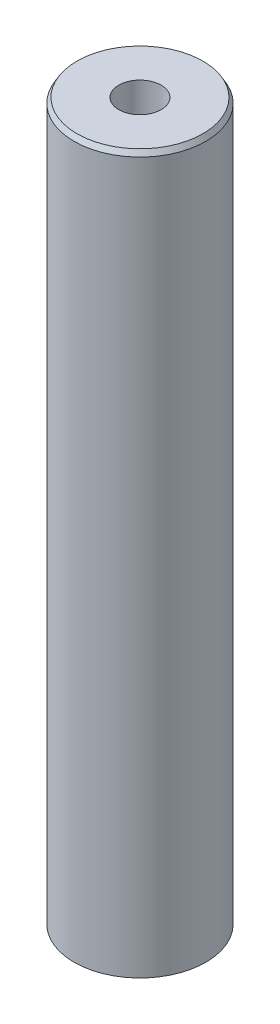
ISO-10303-21;
HEADER;
FILE_DESCRIPTION(('STEP AP214'),'2;1');
FILE_NAME('part.step','',(''),(''),'','','');
FILE_SCHEMA(('AUTOMOTIVE_DESIGN { 1 0 10303 214 1 1 1 1 }'));
ENDSEC;
DATA;
#1=APPLICATION_CONTEXT('core data for automotive mechanical design processes');
#2=APPLICATION_PROTOCOL_DEFINITION('international standard','automotive_design',2000,#1);
#3=PRODUCT_CONTEXT('',#1,'mechanical');
#4=PRODUCT('Part','Part','',(#3));
#5=PRODUCT_RELATED_PRODUCT_CATEGORY('part','',(#4));
#6=PRODUCT_DEFINITION_FORMATION('','',#4);
#7=PRODUCT_DEFINITION_CONTEXT('part definition',#1,'design');
#8=PRODUCT_DEFINITION('design','',#6,#7);
#9=PRODUCT_DEFINITION_SHAPE('','',#8);
#10=(LENGTH_UNIT() NAMED_UNIT(*) SI_UNIT(.MILLI.,.METRE.));
#11=(NAMED_UNIT(*) PLANE_ANGLE_UNIT() SI_UNIT($,.RADIAN.));
#12=(NAMED_UNIT(*) SI_UNIT($,.STERADIAN.) SOLID_ANGLE_UNIT());
#13=UNCERTAINTY_MEASURE_WITH_UNIT(LENGTH_MEASURE(1.E-05),#10,'distance_accuracy_value','');
#14=(GEOMETRIC_REPRESENTATION_CONTEXT(3) GLOBAL_UNCERTAINTY_ASSIGNED_CONTEXT((#13)) GLOBAL_UNIT_ASSIGNED_CONTEXT((#10,
#11,#12)) REPRESENTATION_CONTEXT('',''));
#15=CARTESIAN_POINT('',(0.,0.,0.));
#16=DIRECTION('',(0.,0.,1.));
#17=DIRECTION('',(1.,0.,0.));
#18=AXIS2_PLACEMENT_3D('',#15,#16,#17);
#19=CARTESIAN_POINT('',(0.,600.,0.));
#20=DIRECTION('',(0.,-1.,0.));
#21=DIRECTION('',(0.,0.,-1.));
#22=AXIS2_PLACEMENT_3D('',#19,#20,#21);
#23=CYLINDRICAL_SURFACE('',#22,55.);
#24=CARTESIAN_POINT('',(0.,595.74147728262,0.));
#25=DIRECTION('',(0.,1.,0.));
#26=DIRECTION('',(0.,0.,1.));
#27=AXIS2_PLACEMENT_3D('',#24,#25,#26);
#28=CIRCLE('',#27,55.);
#29=CARTESIAN_POINT('',(0.,595.74147728262,55.));
#30=VERTEX_POINT('',#29);
#31=EDGE_CURVE('E50',#30,#30,#28,.F.);
#32=ORIENTED_EDGE('',*,*,#31,.T.);
#33=EDGE_LOOP('',(#32));
#34=FACE_BOUND('',#33,.T.);
#35=CARTESIAN_POINT('',(0.,2.45865923722954,0.));
#36=DIRECTION('',(0.,1.,0.));
#37=DIRECTION('',(0.,0.,1.));
#38=AXIS2_PLACEMENT_3D('',#35,#36,#37);
#39=CIRCLE('',#38,55.);
#40=CARTESIAN_POINT('',(0.,2.45865923722954,55.));
#41=VERTEX_POINT('',#40);
#42=EDGE_CURVE('E51',#41,#41,#39,.T.);
#43=ORIENTED_EDGE('',*,*,#42,.T.);
#44=EDGE_LOOP('',(#43));
#45=FACE_BOUND('',#44,.T.);
#46=ADVANCED_FACE('F39',(#34,#45),#23,.T.);
#47=CARTESIAN_POINT('',(0.,600.,0.));
#48=DIRECTION('',(0.,1.,0.));
#49=DIRECTION('',(0.,0.,1.));
#50=AXIS2_PLACEMENT_3D('',#47,#48,#49);
#51=PLANE('',#50);
#52=CARTESIAN_POINT('',(0.,600.,0.));
#53=DIRECTION('',(0.,1.,0.));
#54=DIRECTION('',(0.,0.,1.));
#55=AXIS2_PLACEMENT_3D('',#52,#53,#54);
#56=CIRCLE('',#55,52.5413407627703);
#57=CARTESIAN_POINT('',(0.,600.,52.5413407627703));
#58=VERTEX_POINT('',#57);
#59=EDGE_CURVE('E54',#58,#58,#56,.T.);
#60=ORIENTED_EDGE('',*,*,#59,.T.);
#61=EDGE_LOOP('',(#60));
#62=FACE_BOUND('',#61,.T.);
#63=CARTESIAN_POINT('',(0.,600.,0.));
#64=DIRECTION('',(0.,1.,0.));
#65=DIRECTION('',(0.,0.,1.));
#66=AXIS2_PLACEMENT_3D('',#63,#64,#65);
#67=CIRCLE('',#66,17.7144658697035);
#68=CARTESIAN_POINT('',(0.,600.,17.7144658697035));
#69=VERTEX_POINT('',#68);
#70=EDGE_CURVE('E58',#69,#69,#67,.T.);
#71=ORIENTED_EDGE('',*,*,#70,.F.);
#72=EDGE_LOOP('',(#71));
#73=FACE_BOUND('',#72,.T.);
#74=ADVANCED_FACE('F69',(#62,#73),#51,.T.);
#75=CARTESIAN_POINT('',(0.,0.,0.));
#76=DIRECTION('',(0.,1.,0.));
#77=DIRECTION('',(0.,0.,1.));
#78=AXIS2_PLACEMENT_3D('',#75,#76,#77);
#79=PLANE('',#78);
#80=CARTESIAN_POINT('',(0.,0.,0.));
#81=DIRECTION('',(0.,1.,0.));
#82=DIRECTION('',(0.,0.,1.));
#83=AXIS2_PLACEMENT_3D('',#80,#81,#82);
#84=CIRCLE('',#83,50.7414772826198);
#85=CARTESIAN_POINT('',(0.,0.,50.7414772826198));
#86=VERTEX_POINT('',#85);
#87=EDGE_CURVE('E10',#86,#86,#84,.F.);
#88=ORIENTED_EDGE('',*,*,#87,.T.);
#89=EDGE_LOOP('',(#88));
#90=FACE_BOUND('',#89,.T.);
#91=CARTESIAN_POINT('',(0.,0.,0.));
#92=DIRECTION('',(0.,1.,0.));
#93=DIRECTION('',(0.,0.,1.));
#94=AXIS2_PLACEMENT_3D('',#91,#92,#93);
#95=CIRCLE('',#94,17.7144658697035);
#96=CARTESIAN_POINT('',(0.,0.,17.7144658697035));
#97=VERTEX_POINT('',#96);
#98=EDGE_CURVE('E63',#97,#97,#95,.T.);
#99=ORIENTED_EDGE('',*,*,#98,.T.);
#100=EDGE_LOOP('',(#99));
#101=FACE_BOUND('',#100,.T.);
#102=ADVANCED_FACE('F75',(#90,#101),#79,.F.);
#103=CARTESIAN_POINT('',(0.,600.,0.));
#104=DIRECTION('',(0.,-1.,0.));
#105=DIRECTION('',(0.,0.,-1.));
#106=AXIS2_PLACEMENT_3D('',#103,#104,#105);
#107=CYLINDRICAL_SURFACE('',#106,17.7144658697035);
#108=ORIENTED_EDGE('',*,*,#70,.T.);
#109=EDGE_LOOP('',(#108));
#110=FACE_BOUND('',#109,.T.);
#111=ORIENTED_EDGE('',*,*,#98,.F.);
#112=EDGE_LOOP('',(#111));
#113=FACE_BOUND('',#112,.T.);
#114=ADVANCED_FACE('F70',(#110,#113),#107,.F.);
#115=CARTESIAN_POINT('',(0.,600.,0.));
#116=DIRECTION('',(0.,-1.,0.));
#117=DIRECTION('',(0.,0.,-1.));
#118=AXIS2_PLACEMENT_3D('',#115,#116,#117);
#119=CONICAL_SURFACE('',#118,52.5413407627703,0.523598775598294);
#120=ORIENTED_EDGE('',*,*,#31,.F.);
#121=EDGE_LOOP('',(#120));
#122=FACE_BOUND('',#121,.T.);
#123=ORIENTED_EDGE('',*,*,#59,.F.);
#124=EDGE_LOOP('',(#123));
#125=FACE_BOUND('',#124,.T.);
#126=ADVANCED_FACE('F81',(#122,#125),#119,.T.);
#127=CARTESIAN_POINT('',(0.,2.45865923722954,0.));
#128=DIRECTION('',(0.,1.,0.));
#129=DIRECTION('',(0.,0.,1.));
#130=AXIS2_PLACEMENT_3D('',#127,#128,#129);
#131=CONICAL_SURFACE('',#130,55.,1.04719755119661);
#132=ORIENTED_EDGE('',*,*,#87,.F.);
#133=EDGE_LOOP('',(#132));
#134=FACE_BOUND('',#133,.T.);
#135=ORIENTED_EDGE('',*,*,#42,.F.);
#136=EDGE_LOOP('',(#135));
#137=FACE_BOUND('',#136,.T.);
#138=ADVANCED_FACE('F45',(#134,#137),#131,.T.);
#139=CLOSED_SHELL('',(#46,#74,#102,#114,#126,#138));
#140=MANIFOLD_SOLID_BREP('B2',#139);
#141=ADVANCED_BREP_SHAPE_REPRESENTATION('',(#18,#140),#14);
#142=SHAPE_DEFINITION_REPRESENTATION(#9,#141);
ENDSEC;
END-ISO-10303-21;
